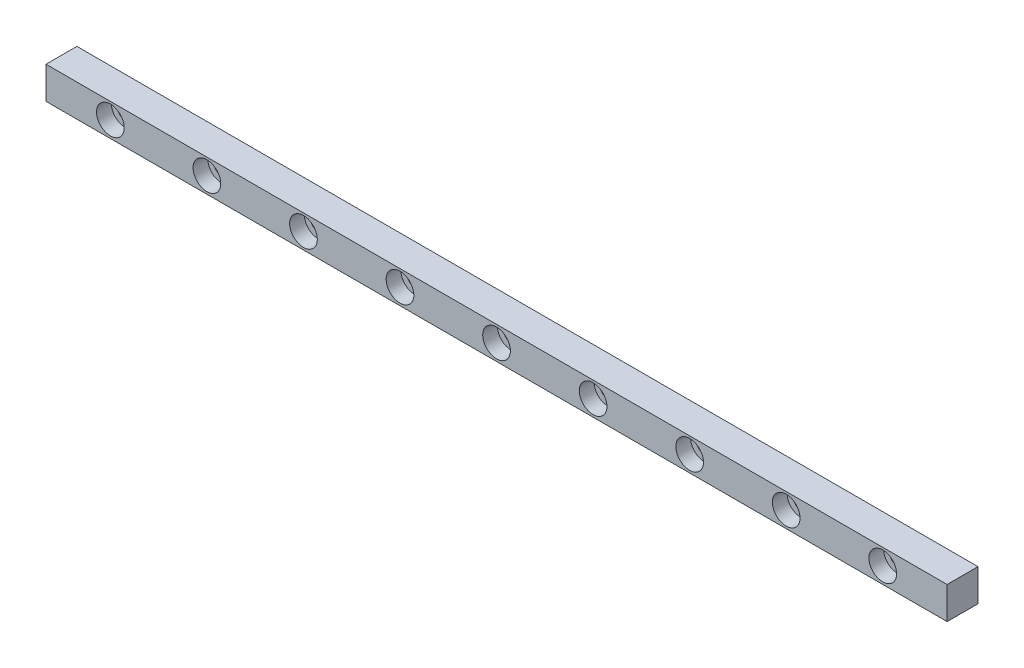
ISO-10303-21;
HEADER;
FILE_DESCRIPTION(('STEP AP214'),'2;1');
FILE_NAME('part.step','',(''),(''),'','','');
FILE_SCHEMA(('AUTOMOTIVE_DESIGN { 1 0 10303 214 1 1 1 1 }'));
ENDSEC;
DATA;
#1=APPLICATION_CONTEXT('core data for automotive mechanical design processes');
#2=APPLICATION_PROTOCOL_DEFINITION('international standard','automotive_design',2000,#1);
#3=PRODUCT_CONTEXT('',#1,'mechanical');
#4=PRODUCT('Part','Part','',(#3));
#5=PRODUCT_RELATED_PRODUCT_CATEGORY('part','',(#4));
#6=PRODUCT_DEFINITION_FORMATION('','',#4);
#7=PRODUCT_DEFINITION_CONTEXT('part definition',#1,'design');
#8=PRODUCT_DEFINITION('design','',#6,#7);
#9=PRODUCT_DEFINITION_SHAPE('','',#8);
#10=(LENGTH_UNIT() NAMED_UNIT(*) SI_UNIT(.MILLI.,.METRE.));
#11=(NAMED_UNIT(*) PLANE_ANGLE_UNIT() SI_UNIT($,.RADIAN.));
#12=(NAMED_UNIT(*) SI_UNIT($,.STERADIAN.) SOLID_ANGLE_UNIT());
#13=UNCERTAINTY_MEASURE_WITH_UNIT(LENGTH_MEASURE(1.E-05),#10,'distance_accuracy_value','');
#14=(GEOMETRIC_REPRESENTATION_CONTEXT(3) GLOBAL_UNCERTAINTY_ASSIGNED_CONTEXT((#13)) GLOBAL_UNIT_ASSIGNED_CONTEXT((#10,
#11,#12)) REPRESENTATION_CONTEXT('',''));
#15=CARTESIAN_POINT('',(0.,0.,0.));
#16=DIRECTION('',(0.,0.,1.));
#17=DIRECTION('',(1.,0.,0.));
#18=AXIS2_PLACEMENT_3D('',#15,#16,#17);
#19=CARTESIAN_POINT('',(-70.,-2.50000000000001,4.8));
#20=DIRECTION('',(1.,0.,0.));
#21=DIRECTION('',(0.,0.,-1.));
#22=AXIS2_PLACEMENT_3D('',#19,#20,#21);
#23=PLANE('',#22);
#24=DIRECTION('',(0.,-1.,0.));
#25=VECTOR('',#24,1.);
#26=CARTESIAN_POINT('',(-70.,-2.50000000000001,0.));
#27=LINE('',#26,#25);
#28=CARTESIAN_POINT('',(-70.,2.49999999999999,0.));
#29=VERTEX_POINT('',#28);
#30=CARTESIAN_POINT('',(-70.,-2.50000000000001,0.));
#31=VERTEX_POINT('',#30);
#32=EDGE_CURVE('E110',#29,#31,#27,.T.);
#33=ORIENTED_EDGE('',*,*,#32,.T.);
#34=DIRECTION('',(0.,0.,-1.));
#35=VECTOR('',#34,1.);
#36=CARTESIAN_POINT('',(-70.,-2.50000000000001,4.8));
#37=LINE('',#36,#35);
#38=CARTESIAN_POINT('',(-70.,-2.50000000000001,4.8));
#39=VERTEX_POINT('',#38);
#40=EDGE_CURVE('E11',#39,#31,#37,.T.);
#41=ORIENTED_EDGE('',*,*,#40,.F.);
#42=DIRECTION('',(0.,-1.,0.));
#43=VECTOR('',#42,1.);
#44=CARTESIAN_POINT('',(-70.,-2.50000000000001,4.8));
#45=LINE('',#44,#43);
#46=CARTESIAN_POINT('',(-70.,2.49999999999999,4.8));
#47=VERTEX_POINT('',#46);
#48=EDGE_CURVE('E93',#47,#39,#45,.T.);
#49=ORIENTED_EDGE('',*,*,#48,.F.);
#50=DIRECTION('',(0.,0.,-1.));
#51=VECTOR('',#50,1.);
#52=CARTESIAN_POINT('',(-70.,2.49999999999999,4.8));
#53=LINE('',#52,#51);
#54=EDGE_CURVE('E106',#47,#29,#53,.T.);
#55=ORIENTED_EDGE('',*,*,#54,.T.);
#56=EDGE_LOOP('',(#33,#41,#49,#55));
#57=FACE_BOUND('',#56,.T.);
#58=ADVANCED_FACE('F39',(#57),#23,.F.);
#59=CARTESIAN_POINT('',(70.,-2.49999999999999,4.8));
#60=DIRECTION('',(0.,1.,0.));
#61=DIRECTION('',(-1.,0.,0.));
#62=AXIS2_PLACEMENT_3D('',#59,#60,#61);
#63=PLANE('',#62);
#64=DIRECTION('',(1.,0.,0.));
#65=VECTOR('',#64,1.);
#66=CARTESIAN_POINT('',(70.,-2.49999999999999,0.));
#67=LINE('',#66,#65);
#68=CARTESIAN_POINT('',(70.,-2.49999999999999,0.));
#69=VERTEX_POINT('',#68);
#70=EDGE_CURVE('E98',#31,#69,#67,.T.);
#71=ORIENTED_EDGE('',*,*,#70,.T.);
#72=DIRECTION('',(0.,0.,-1.));
#73=VECTOR('',#72,1.);
#74=CARTESIAN_POINT('',(70.,-2.49999999999999,4.8));
#75=LINE('',#74,#73);
#76=CARTESIAN_POINT('',(70.,-2.49999999999999,4.8));
#77=VERTEX_POINT('',#76);
#78=EDGE_CURVE('E49',#77,#69,#75,.T.);
#79=ORIENTED_EDGE('',*,*,#78,.F.);
#80=DIRECTION('',(1.,0.,0.));
#81=VECTOR('',#80,1.);
#82=CARTESIAN_POINT('',(70.,-2.49999999999999,4.8));
#83=LINE('',#82,#81);
#84=EDGE_CURVE('E88',#39,#77,#83,.T.);
#85=ORIENTED_EDGE('',*,*,#84,.F.);
#86=ORIENTED_EDGE('',*,*,#40,.T.);
#87=EDGE_LOOP('',(#71,#79,#85,#86));
#88=FACE_BOUND('',#87,.T.);
#89=ADVANCED_FACE('F97',(#88),#63,.F.);
#90=CARTESIAN_POINT('',(70.,-2.49999999999999,4.8));
#91=DIRECTION('',(-1.,0.,0.));
#92=DIRECTION('',(0.,0.,1.));
#93=AXIS2_PLACEMENT_3D('',#90,#91,#92);
#94=PLANE('',#93);
#95=DIRECTION('',(0.,1.,0.));
#96=VECTOR('',#95,1.);
#97=CARTESIAN_POINT('',(70.,-2.49999999999999,0.));
#98=LINE('',#97,#96);
#99=CARTESIAN_POINT('',(70.,2.50000000000001,0.));
#100=VERTEX_POINT('',#99);
#101=EDGE_CURVE('E75',#69,#100,#98,.T.);
#102=ORIENTED_EDGE('',*,*,#101,.T.);
#103=DIRECTION('',(0.,0.,-1.));
#104=VECTOR('',#103,1.);
#105=CARTESIAN_POINT('',(70.,2.50000000000001,4.8));
#106=LINE('',#105,#104);
#107=CARTESIAN_POINT('',(70.,2.50000000000001,4.8));
#108=VERTEX_POINT('',#107);
#109=EDGE_CURVE('E100',#108,#100,#106,.T.);
#110=ORIENTED_EDGE('',*,*,#109,.F.);
#111=DIRECTION('',(0.,1.,0.));
#112=VECTOR('',#111,1.);
#113=CARTESIAN_POINT('',(70.,-2.49999999999999,4.8));
#114=LINE('',#113,#112);
#115=EDGE_CURVE('E91',#77,#108,#114,.T.);
#116=ORIENTED_EDGE('',*,*,#115,.F.);
#117=ORIENTED_EDGE('',*,*,#78,.T.);
#118=EDGE_LOOP('',(#102,#110,#116,#117));
#119=FACE_BOUND('',#118,.T.);
#120=ADVANCED_FACE('F102',(#119),#94,.F.);
#121=CARTESIAN_POINT('',(70.,2.50000000000001,4.8));
#122=DIRECTION('',(0.,-1.,0.));
#123=DIRECTION('',(1.,0.,0.));
#124=AXIS2_PLACEMENT_3D('',#121,#122,#123);
#125=PLANE('',#124);
#126=DIRECTION('',(-1.,0.,0.));
#127=VECTOR('',#126,1.);
#128=CARTESIAN_POINT('',(70.,2.50000000000001,0.));
#129=LINE('',#128,#127);
#130=EDGE_CURVE('E81',#100,#29,#129,.T.);
#131=ORIENTED_EDGE('',*,*,#130,.T.);
#132=ORIENTED_EDGE('',*,*,#54,.F.);
#133=DIRECTION('',(-1.,0.,0.));
#134=VECTOR('',#133,1.);
#135=CARTESIAN_POINT('',(70.,2.50000000000001,4.8));
#136=LINE('',#135,#134);
#137=EDGE_CURVE('E58',#108,#47,#136,.T.);
#138=ORIENTED_EDGE('',*,*,#137,.F.);
#139=ORIENTED_EDGE('',*,*,#109,.T.);
#140=EDGE_LOOP('',(#131,#132,#138,#139));
#141=FACE_BOUND('',#140,.T.);
#142=ADVANCED_FACE('F273',(#141),#125,.F.);
#143=CARTESIAN_POINT('',(0.,0.,4.8));
#144=DIRECTION('',(0.,0.,1.));
#145=DIRECTION('',(1.,0.,0.));
#146=AXIS2_PLACEMENT_3D('',#143,#144,#145);
#147=PLANE('',#146);
#148=CARTESIAN_POINT('',(-60.,0.,4.8));
#149=DIRECTION('',(0.,0.,1.));
#150=DIRECTION('',(1.,0.,0.));
#151=AXIS2_PLACEMENT_3D('',#148,#149,#150);
#152=CIRCLE('',#151,2.15);
#153=CARTESIAN_POINT('',(-57.85,0.,4.8));
#154=VERTEX_POINT('',#153);
#155=EDGE_CURVE('E579',#154,#154,#152,.T.);
#156=ORIENTED_EDGE('',*,*,#155,.F.);
#157=EDGE_LOOP('',(#156));
#158=FACE_BOUND('',#157,.T.);
#159=CARTESIAN_POINT('',(-45.,0.,4.8));
#160=DIRECTION('',(0.,0.,1.));
#161=DIRECTION('',(1.,0.,0.));
#162=AXIS2_PLACEMENT_3D('',#159,#160,#161);
#163=CIRCLE('',#162,2.15);
#164=CARTESIAN_POINT('',(-42.85,0.,4.8));
#165=VERTEX_POINT('',#164);
#166=EDGE_CURVE('E183',#165,#165,#163,.T.);
#167=ORIENTED_EDGE('',*,*,#166,.F.);
#168=EDGE_LOOP('',(#167));
#169=FACE_BOUND('',#168,.T.);
#170=CARTESIAN_POINT('',(-30.,0.,4.8));
#171=DIRECTION('',(0.,0.,1.));
#172=DIRECTION('',(1.,0.,0.));
#173=AXIS2_PLACEMENT_3D('',#170,#171,#172);
#174=CIRCLE('',#173,2.15);
#175=CARTESIAN_POINT('',(-27.85,0.,4.8));
#176=VERTEX_POINT('',#175);
#177=EDGE_CURVE('E167',#176,#176,#174,.T.);
#178=ORIENTED_EDGE('',*,*,#177,.F.);
#179=EDGE_LOOP('',(#178));
#180=FACE_BOUND('',#179,.T.);
#181=CARTESIAN_POINT('',(-15.,0.,4.8));
#182=DIRECTION('',(0.,0.,1.));
#183=DIRECTION('',(1.,0.,0.));
#184=AXIS2_PLACEMENT_3D('',#181,#182,#183);
#185=CIRCLE('',#184,2.15);
#186=CARTESIAN_POINT('',(-12.85,0.,4.8));
#187=VERTEX_POINT('',#186);
#188=EDGE_CURVE('E162',#187,#187,#185,.T.);
#189=ORIENTED_EDGE('',*,*,#188,.F.);
#190=EDGE_LOOP('',(#189));
#191=FACE_BOUND('',#190,.T.);
#192=CARTESIAN_POINT('',(0.,0.,4.8));
#193=DIRECTION('',(0.,0.,1.));
#194=DIRECTION('',(1.,0.,0.));
#195=AXIS2_PLACEMENT_3D('',#192,#193,#194);
#196=CIRCLE('',#195,2.15);
#197=CARTESIAN_POINT('',(2.15000000000001,0.,4.8));
#198=VERTEX_POINT('',#197);
#199=EDGE_CURVE('E157',#198,#198,#196,.T.);
#200=ORIENTED_EDGE('',*,*,#199,.F.);
#201=EDGE_LOOP('',(#200));
#202=FACE_BOUND('',#201,.T.);
#203=CARTESIAN_POINT('',(15.,0.,4.8));
#204=DIRECTION('',(0.,0.,1.));
#205=DIRECTION('',(1.,0.,0.));
#206=AXIS2_PLACEMENT_3D('',#203,#204,#205);
#207=CIRCLE('',#206,2.15);
#208=CARTESIAN_POINT('',(17.15,0.,4.8));
#209=VERTEX_POINT('',#208);
#210=EDGE_CURVE('E151',#209,#209,#207,.T.);
#211=ORIENTED_EDGE('',*,*,#210,.F.);
#212=EDGE_LOOP('',(#211));
#213=FACE_BOUND('',#212,.T.);
#214=CARTESIAN_POINT('',(30.,0.,4.8));
#215=DIRECTION('',(0.,0.,1.));
#216=DIRECTION('',(1.,0.,0.));
#217=AXIS2_PLACEMENT_3D('',#214,#215,#216);
#218=CIRCLE('',#217,2.15);
#219=CARTESIAN_POINT('',(32.15,0.,4.8));
#220=VERTEX_POINT('',#219);
#221=EDGE_CURVE('E145',#220,#220,#218,.T.);
#222=ORIENTED_EDGE('',*,*,#221,.F.);
#223=EDGE_LOOP('',(#222));
#224=FACE_BOUND('',#223,.T.);
#225=CARTESIAN_POINT('',(45.,0.,4.8));
#226=DIRECTION('',(0.,0.,1.));
#227=DIRECTION('',(1.,0.,0.));
#228=AXIS2_PLACEMENT_3D('',#225,#226,#227);
#229=CIRCLE('',#228,2.15);
#230=CARTESIAN_POINT('',(47.15,0.,4.8));
#231=VERTEX_POINT('',#230);
#232=EDGE_CURVE('E139',#231,#231,#229,.T.);
#233=ORIENTED_EDGE('',*,*,#232,.F.);
#234=EDGE_LOOP('',(#233));
#235=FACE_BOUND('',#234,.T.);
#236=CARTESIAN_POINT('',(60.,0.,4.8));
#237=DIRECTION('',(0.,0.,1.));
#238=DIRECTION('',(1.,0.,0.));
#239=AXIS2_PLACEMENT_3D('',#236,#237,#238);
#240=CIRCLE('',#239,2.15);
#241=CARTESIAN_POINT('',(62.15,0.,4.8));
#242=VERTEX_POINT('',#241);
#243=EDGE_CURVE('E133',#242,#242,#240,.T.);
#244=ORIENTED_EDGE('',*,*,#243,.F.);
#245=EDGE_LOOP('',(#244));
#246=FACE_BOUND('',#245,.T.);
#247=ORIENTED_EDGE('',*,*,#48,.T.);
#248=ORIENTED_EDGE('',*,*,#84,.T.);
#249=ORIENTED_EDGE('',*,*,#115,.T.);
#250=ORIENTED_EDGE('',*,*,#137,.T.);
#251=EDGE_LOOP('',(#247,#248,#249,#250));
#252=FACE_BOUND('',#251,.T.);
#253=ADVANCED_FACE('F89',(#158,#169,#180,#191,#202,#213,#224,#235,#246,#252),#147,.T.);
#254=CARTESIAN_POINT('',(0.,0.,0.));
#255=DIRECTION('',(0.,0.,1.));
#256=DIRECTION('',(1.,0.,0.));
#257=AXIS2_PLACEMENT_3D('',#254,#255,#256);
#258=PLANE('',#257);
#259=CARTESIAN_POINT('',(-60.,0.,0.));
#260=DIRECTION('',(0.,0.,1.));
#261=DIRECTION('',(1.,0.,0.));
#262=AXIS2_PLACEMENT_3D('',#259,#260,#261);
#263=CIRCLE('',#262,1.2);
#264=CARTESIAN_POINT('',(-58.8,0.,0.));
#265=VERTEX_POINT('',#264);
#266=EDGE_CURVE('E42',#265,#265,#263,.T.);
#267=ORIENTED_EDGE('',*,*,#266,.T.);
#268=EDGE_LOOP('',(#267));
#269=FACE_BOUND('',#268,.T.);
#270=CARTESIAN_POINT('',(-45.,0.,0.));
#271=DIRECTION('',(0.,0.,1.));
#272=DIRECTION('',(1.,0.,0.));
#273=AXIS2_PLACEMENT_3D('',#270,#271,#272);
#274=CIRCLE('',#273,1.2);
#275=CARTESIAN_POINT('',(-43.8,0.,0.));
#276=VERTEX_POINT('',#275);
#277=EDGE_CURVE('E164',#276,#276,#274,.T.);
#278=ORIENTED_EDGE('',*,*,#277,.T.);
#279=EDGE_LOOP('',(#278));
#280=FACE_BOUND('',#279,.T.);
#281=CARTESIAN_POINT('',(-30.,0.,0.));
#282=DIRECTION('',(0.,0.,1.));
#283=DIRECTION('',(1.,0.,0.));
#284=AXIS2_PLACEMENT_3D('',#281,#282,#283);
#285=CIRCLE('',#284,1.2);
#286=CARTESIAN_POINT('',(-28.8,0.,0.));
#287=VERTEX_POINT('',#286);
#288=EDGE_CURVE('E159',#287,#287,#285,.T.);
#289=ORIENTED_EDGE('',*,*,#288,.T.);
#290=EDGE_LOOP('',(#289));
#291=FACE_BOUND('',#290,.T.);
#292=CARTESIAN_POINT('',(-15.,0.,0.));
#293=DIRECTION('',(0.,0.,1.));
#294=DIRECTION('',(1.,0.,0.));
#295=AXIS2_PLACEMENT_3D('',#292,#293,#294);
#296=CIRCLE('',#295,1.2);
#297=CARTESIAN_POINT('',(-13.8,0.,0.));
#298=VERTEX_POINT('',#297);
#299=EDGE_CURVE('E153',#298,#298,#296,.T.);
#300=ORIENTED_EDGE('',*,*,#299,.T.);
#301=EDGE_LOOP('',(#300));
#302=FACE_BOUND('',#301,.T.);
#303=CARTESIAN_POINT('',(0.,0.,0.));
#304=DIRECTION('',(0.,0.,1.));
#305=DIRECTION('',(1.,0.,0.));
#306=AXIS2_PLACEMENT_3D('',#303,#304,#305);
#307=CIRCLE('',#306,1.2);
#308=CARTESIAN_POINT('',(1.20000000000001,0.,0.));
#309=VERTEX_POINT('',#308);
#310=EDGE_CURVE('E147',#309,#309,#307,.T.);
#311=ORIENTED_EDGE('',*,*,#310,.T.);
#312=EDGE_LOOP('',(#311));
#313=FACE_BOUND('',#312,.T.);
#314=CARTESIAN_POINT('',(15.,0.,0.));
#315=DIRECTION('',(0.,0.,1.));
#316=DIRECTION('',(1.,0.,0.));
#317=AXIS2_PLACEMENT_3D('',#314,#315,#316);
#318=CIRCLE('',#317,1.2);
#319=CARTESIAN_POINT('',(16.2,0.,0.));
#320=VERTEX_POINT('',#319);
#321=EDGE_CURVE('E141',#320,#320,#318,.T.);
#322=ORIENTED_EDGE('',*,*,#321,.T.);
#323=EDGE_LOOP('',(#322));
#324=FACE_BOUND('',#323,.T.);
#325=CARTESIAN_POINT('',(30.,0.,0.));
#326=DIRECTION('',(0.,0.,1.));
#327=DIRECTION('',(1.,0.,0.));
#328=AXIS2_PLACEMENT_3D('',#325,#326,#327);
#329=CIRCLE('',#328,1.2);
#330=CARTESIAN_POINT('',(31.2,0.,0.));
#331=VERTEX_POINT('',#330);
#332=EDGE_CURVE('E135',#331,#331,#329,.T.);
#333=ORIENTED_EDGE('',*,*,#332,.T.);
#334=EDGE_LOOP('',(#333));
#335=FACE_BOUND('',#334,.T.);
#336=CARTESIAN_POINT('',(45.,0.,0.));
#337=DIRECTION('',(0.,0.,1.));
#338=DIRECTION('',(1.,0.,0.));
#339=AXIS2_PLACEMENT_3D('',#336,#337,#338);
#340=CIRCLE('',#339,1.2);
#341=CARTESIAN_POINT('',(46.2,0.,0.));
#342=VERTEX_POINT('',#341);
#343=EDGE_CURVE('E129',#342,#342,#340,.T.);
#344=ORIENTED_EDGE('',*,*,#343,.T.);
#345=EDGE_LOOP('',(#344));
#346=FACE_BOUND('',#345,.T.);
#347=CARTESIAN_POINT('',(60.,0.,0.));
#348=DIRECTION('',(0.,0.,1.));
#349=DIRECTION('',(1.,0.,0.));
#350=AXIS2_PLACEMENT_3D('',#347,#348,#349);
#351=CIRCLE('',#350,1.2);
#352=CARTESIAN_POINT('',(61.2,0.,0.));
#353=VERTEX_POINT('',#352);
#354=EDGE_CURVE('E114',#353,#353,#351,.T.);
#355=ORIENTED_EDGE('',*,*,#354,.T.);
#356=EDGE_LOOP('',(#355));
#357=FACE_BOUND('',#356,.T.);
#358=ORIENTED_EDGE('',*,*,#32,.F.);
#359=ORIENTED_EDGE('',*,*,#130,.F.);
#360=ORIENTED_EDGE('',*,*,#101,.F.);
#361=ORIENTED_EDGE('',*,*,#70,.F.);
#362=EDGE_LOOP('',(#358,#359,#360,#361));
#363=FACE_BOUND('',#362,.T.);
#364=ADVANCED_FACE('F272',(#269,#280,#291,#302,#313,#324,#335,#346,#357,#363),#258,.F.);
#365=CARTESIAN_POINT('',(60.,0.,4.8));
#366=DIRECTION('',(0.,0.,1.));
#367=DIRECTION('',(1.,0.,0.));
#368=AXIS2_PLACEMENT_3D('',#365,#366,#367);
#369=CYLINDRICAL_SURFACE('',#368,1.2);
#370=CARTESIAN_POINT('',(60.,0.,2.5));
#371=DIRECTION('',(0.,0.,1.));
#372=DIRECTION('',(1.,0.,0.));
#373=AXIS2_PLACEMENT_3D('',#370,#371,#372);
#374=CIRCLE('',#373,1.2);
#375=CARTESIAN_POINT('',(61.2,0.,2.5));
#376=VERTEX_POINT('',#375);
#377=EDGE_CURVE('E128',#376,#376,#374,.T.);
#378=ORIENTED_EDGE('',*,*,#377,.T.);
#379=EDGE_LOOP('',(#378));
#380=FACE_BOUND('',#379,.T.);
#381=ORIENTED_EDGE('',*,*,#354,.F.);
#382=EDGE_LOOP('',(#381));
#383=FACE_BOUND('',#382,.T.);
#384=ADVANCED_FACE('F255',(#380,#383),#369,.F.);
#385=CARTESIAN_POINT('',(61.2,0.,2.5));
#386=DIRECTION('',(0.,0.,-1.));
#387=DIRECTION('',(-1.,0.,0.));
#388=AXIS2_PLACEMENT_3D('',#385,#386,#387);
#389=PLANE('',#388);
#390=ORIENTED_EDGE('',*,*,#377,.F.);
#391=EDGE_LOOP('',(#390));
#392=FACE_BOUND('',#391,.T.);
#393=CARTESIAN_POINT('',(60.,0.,2.5));
#394=DIRECTION('',(0.,0.,1.));
#395=DIRECTION('',(1.,0.,0.));
#396=AXIS2_PLACEMENT_3D('',#393,#394,#395);
#397=CIRCLE('',#396,2.15);
#398=CARTESIAN_POINT('',(62.15,0.,2.5));
#399=VERTEX_POINT('',#398);
#400=EDGE_CURVE('E246',#399,#399,#397,.T.);
#401=ORIENTED_EDGE('',*,*,#400,.T.);
#402=EDGE_LOOP('',(#401));
#403=FACE_BOUND('',#402,.T.);
#404=ADVANCED_FACE('F258',(#392,#403),#389,.F.);
#405=CARTESIAN_POINT('',(60.,0.,4.8));
#406=DIRECTION('',(0.,0.,1.));
#407=DIRECTION('',(1.,0.,0.));
#408=AXIS2_PLACEMENT_3D('',#405,#406,#407);
#409=CYLINDRICAL_SURFACE('',#408,2.15);
#410=ORIENTED_EDGE('',*,*,#400,.F.);
#411=EDGE_LOOP('',(#410));
#412=FACE_BOUND('',#411,.T.);
#413=ORIENTED_EDGE('',*,*,#243,.T.);
#414=EDGE_LOOP('',(#413));
#415=FACE_BOUND('',#414,.T.);
#416=ADVANCED_FACE('F261',(#412,#415),#409,.F.);
#417=CARTESIAN_POINT('',(45.,0.,4.8));
#418=DIRECTION('',(0.,0.,1.));
#419=DIRECTION('',(1.,0.,0.));
#420=AXIS2_PLACEMENT_3D('',#417,#418,#419);
#421=CYLINDRICAL_SURFACE('',#420,1.2);
#422=CARTESIAN_POINT('',(45.,0.,2.5));
#423=DIRECTION('',(0.,0.,1.));
#424=DIRECTION('',(1.,0.,0.));
#425=AXIS2_PLACEMENT_3D('',#422,#423,#424);
#426=CIRCLE('',#425,1.2);
#427=CARTESIAN_POINT('',(46.2,0.,2.5));
#428=VERTEX_POINT('',#427);
#429=EDGE_CURVE('E134',#428,#428,#426,.T.);
#430=ORIENTED_EDGE('',*,*,#429,.T.);
#431=EDGE_LOOP('',(#430));
#432=FACE_BOUND('',#431,.T.);
#433=ORIENTED_EDGE('',*,*,#343,.F.);
#434=EDGE_LOOP('',(#433));
#435=FACE_BOUND('',#434,.T.);
#436=ADVANCED_FACE('F267',(#432,#435),#421,.F.);
#437=CARTESIAN_POINT('',(46.2,0.,2.5));
#438=DIRECTION('',(0.,0.,-1.));
#439=DIRECTION('',(-1.,0.,0.));
#440=AXIS2_PLACEMENT_3D('',#437,#438,#439);
#441=PLANE('',#440);
#442=ORIENTED_EDGE('',*,*,#429,.F.);
#443=EDGE_LOOP('',(#442));
#444=FACE_BOUND('',#443,.T.);
#445=CARTESIAN_POINT('',(45.,0.,2.5));
#446=DIRECTION('',(0.,0.,1.));
#447=DIRECTION('',(1.,0.,0.));
#448=AXIS2_PLACEMENT_3D('',#445,#446,#447);
#449=CIRCLE('',#448,2.15);
#450=CARTESIAN_POINT('',(47.15,0.,2.5));
#451=VERTEX_POINT('',#450);
#452=EDGE_CURVE('E236',#451,#451,#449,.T.);
#453=ORIENTED_EDGE('',*,*,#452,.T.);
#454=EDGE_LOOP('',(#453));
#455=FACE_BOUND('',#454,.T.);
#456=ADVANCED_FACE('F341',(#444,#455),#441,.F.);
#457=CARTESIAN_POINT('',(45.,0.,4.8));
#458=DIRECTION('',(0.,0.,1.));
#459=DIRECTION('',(1.,0.,0.));
#460=AXIS2_PLACEMENT_3D('',#457,#458,#459);
#461=CYLINDRICAL_SURFACE('',#460,2.15);
#462=ORIENTED_EDGE('',*,*,#452,.F.);
#463=EDGE_LOOP('',(#462));
#464=FACE_BOUND('',#463,.T.);
#465=ORIENTED_EDGE('',*,*,#232,.T.);
#466=EDGE_LOOP('',(#465));
#467=FACE_BOUND('',#466,.T.);
#468=ADVANCED_FACE('F351',(#464,#467),#461,.F.);
#469=CARTESIAN_POINT('',(30.,0.,4.8));
#470=DIRECTION('',(0.,0.,1.));
#471=DIRECTION('',(1.,0.,0.));
#472=AXIS2_PLACEMENT_3D('',#469,#470,#471);
#473=CYLINDRICAL_SURFACE('',#472,1.2);
#474=CARTESIAN_POINT('',(30.,0.,2.5));
#475=DIRECTION('',(0.,0.,1.));
#476=DIRECTION('',(1.,0.,0.));
#477=AXIS2_PLACEMENT_3D('',#474,#475,#476);
#478=CIRCLE('',#477,1.2);
#479=CARTESIAN_POINT('',(31.2,0.,2.5));
#480=VERTEX_POINT('',#479);
#481=EDGE_CURVE('E140',#480,#480,#478,.T.);
#482=ORIENTED_EDGE('',*,*,#481,.T.);
#483=EDGE_LOOP('',(#482));
#484=FACE_BOUND('',#483,.T.);
#485=ORIENTED_EDGE('',*,*,#332,.F.);
#486=EDGE_LOOP('',(#485));
#487=FACE_BOUND('',#486,.T.);
#488=ADVANCED_FACE('F361',(#484,#487),#473,.F.);
#489=CARTESIAN_POINT('',(31.2,0.,2.5));
#490=DIRECTION('',(0.,0.,-1.));
#491=DIRECTION('',(-1.,0.,0.));
#492=AXIS2_PLACEMENT_3D('',#489,#490,#491);
#493=PLANE('',#492);
#494=ORIENTED_EDGE('',*,*,#481,.F.);
#495=EDGE_LOOP('',(#494));
#496=FACE_BOUND('',#495,.T.);
#497=CARTESIAN_POINT('',(30.,0.,2.5));
#498=DIRECTION('',(0.,0.,1.));
#499=DIRECTION('',(1.,0.,0.));
#500=AXIS2_PLACEMENT_3D('',#497,#498,#499);
#501=CIRCLE('',#500,2.15);
#502=CARTESIAN_POINT('',(32.15,0.,2.5));
#503=VERTEX_POINT('',#502);
#504=EDGE_CURVE('E226',#503,#503,#501,.T.);
#505=ORIENTED_EDGE('',*,*,#504,.T.);
#506=EDGE_LOOP('',(#505));
#507=FACE_BOUND('',#506,.T.);
#508=ADVANCED_FACE('F371',(#496,#507),#493,.F.);
#509=CARTESIAN_POINT('',(30.,0.,4.8));
#510=DIRECTION('',(0.,0.,1.));
#511=DIRECTION('',(1.,0.,0.));
#512=AXIS2_PLACEMENT_3D('',#509,#510,#511);
#513=CYLINDRICAL_SURFACE('',#512,2.15);
#514=ORIENTED_EDGE('',*,*,#504,.F.);
#515=EDGE_LOOP('',(#514));
#516=FACE_BOUND('',#515,.T.);
#517=ORIENTED_EDGE('',*,*,#221,.T.);
#518=EDGE_LOOP('',(#517));
#519=FACE_BOUND('',#518,.T.);
#520=ADVANCED_FACE('F381',(#516,#519),#513,.F.);
#521=CARTESIAN_POINT('',(15.,0.,4.8));
#522=DIRECTION('',(0.,0.,1.));
#523=DIRECTION('',(1.,0.,0.));
#524=AXIS2_PLACEMENT_3D('',#521,#522,#523);
#525=CYLINDRICAL_SURFACE('',#524,1.2);
#526=CARTESIAN_POINT('',(15.,0.,2.5));
#527=DIRECTION('',(0.,0.,1.));
#528=DIRECTION('',(1.,0.,0.));
#529=AXIS2_PLACEMENT_3D('',#526,#527,#528);
#530=CIRCLE('',#529,1.2);
#531=CARTESIAN_POINT('',(16.2,0.,2.5));
#532=VERTEX_POINT('',#531);
#533=EDGE_CURVE('E146',#532,#532,#530,.T.);
#534=ORIENTED_EDGE('',*,*,#533,.T.);
#535=EDGE_LOOP('',(#534));
#536=FACE_BOUND('',#535,.T.);
#537=ORIENTED_EDGE('',*,*,#321,.F.);
#538=EDGE_LOOP('',(#537));
#539=FACE_BOUND('',#538,.T.);
#540=ADVANCED_FACE('F391',(#536,#539),#525,.F.);
#541=CARTESIAN_POINT('',(16.2,0.,2.5));
#542=DIRECTION('',(0.,0.,-1.));
#543=DIRECTION('',(-1.,0.,0.));
#544=AXIS2_PLACEMENT_3D('',#541,#542,#543);
#545=PLANE('',#544);
#546=ORIENTED_EDGE('',*,*,#533,.F.);
#547=EDGE_LOOP('',(#546));
#548=FACE_BOUND('',#547,.T.);
#549=CARTESIAN_POINT('',(15.,0.,2.5));
#550=DIRECTION('',(0.,0.,1.));
#551=DIRECTION('',(1.,0.,0.));
#552=AXIS2_PLACEMENT_3D('',#549,#550,#551);
#553=CIRCLE('',#552,2.15);
#554=CARTESIAN_POINT('',(17.15,0.,2.5));
#555=VERTEX_POINT('',#554);
#556=EDGE_CURVE('E216',#555,#555,#553,.T.);
#557=ORIENTED_EDGE('',*,*,#556,.T.);
#558=EDGE_LOOP('',(#557));
#559=FACE_BOUND('',#558,.T.);
#560=ADVANCED_FACE('F401',(#548,#559),#545,.F.);
#561=CARTESIAN_POINT('',(15.,0.,4.8));
#562=DIRECTION('',(0.,0.,1.));
#563=DIRECTION('',(1.,0.,0.));
#564=AXIS2_PLACEMENT_3D('',#561,#562,#563);
#565=CYLINDRICAL_SURFACE('',#564,2.15);
#566=ORIENTED_EDGE('',*,*,#556,.F.);
#567=EDGE_LOOP('',(#566));
#568=FACE_BOUND('',#567,.T.);
#569=ORIENTED_EDGE('',*,*,#210,.T.);
#570=EDGE_LOOP('',(#569));
#571=FACE_BOUND('',#570,.T.);
#572=ADVANCED_FACE('F411',(#568,#571),#565,.F.);
#573=CARTESIAN_POINT('',(0.,0.,4.8));
#574=DIRECTION('',(0.,0.,1.));
#575=DIRECTION('',(1.,0.,0.));
#576=AXIS2_PLACEMENT_3D('',#573,#574,#575);
#577=CYLINDRICAL_SURFACE('',#576,1.2);
#578=CARTESIAN_POINT('',(0.,0.,2.5));
#579=DIRECTION('',(0.,0.,1.));
#580=DIRECTION('',(1.,0.,0.));
#581=AXIS2_PLACEMENT_3D('',#578,#579,#580);
#582=CIRCLE('',#581,1.2);
#583=CARTESIAN_POINT('',(1.20000000000001,0.,2.5));
#584=VERTEX_POINT('',#583);
#585=EDGE_CURVE('E152',#584,#584,#582,.T.);
#586=ORIENTED_EDGE('',*,*,#585,.T.);
#587=EDGE_LOOP('',(#586));
#588=FACE_BOUND('',#587,.T.);
#589=ORIENTED_EDGE('',*,*,#310,.F.);
#590=EDGE_LOOP('',(#589));
#591=FACE_BOUND('',#590,.T.);
#592=ADVANCED_FACE('F421',(#588,#591),#577,.F.);
#593=CARTESIAN_POINT('',(1.20000000000001,0.,2.5));
#594=DIRECTION('',(0.,0.,-1.));
#595=DIRECTION('',(-1.,0.,0.));
#596=AXIS2_PLACEMENT_3D('',#593,#594,#595);
#597=PLANE('',#596);
#598=ORIENTED_EDGE('',*,*,#585,.F.);
#599=EDGE_LOOP('',(#598));
#600=FACE_BOUND('',#599,.T.);
#601=CARTESIAN_POINT('',(0.,0.,2.5));
#602=DIRECTION('',(0.,0.,1.));
#603=DIRECTION('',(1.,0.,0.));
#604=AXIS2_PLACEMENT_3D('',#601,#602,#603);
#605=CIRCLE('',#604,2.15);
#606=CARTESIAN_POINT('',(2.15000000000001,0.,2.5));
#607=VERTEX_POINT('',#606);
#608=EDGE_CURVE('E206',#607,#607,#605,.T.);
#609=ORIENTED_EDGE('',*,*,#608,.T.);
#610=EDGE_LOOP('',(#609));
#611=FACE_BOUND('',#610,.T.);
#612=ADVANCED_FACE('F431',(#600,#611),#597,.F.);
#613=CARTESIAN_POINT('',(0.,0.,4.8));
#614=DIRECTION('',(0.,0.,1.));
#615=DIRECTION('',(1.,0.,0.));
#616=AXIS2_PLACEMENT_3D('',#613,#614,#615);
#617=CYLINDRICAL_SURFACE('',#616,2.15);
#618=ORIENTED_EDGE('',*,*,#608,.F.);
#619=EDGE_LOOP('',(#618));
#620=FACE_BOUND('',#619,.T.);
#621=ORIENTED_EDGE('',*,*,#199,.T.);
#622=EDGE_LOOP('',(#621));
#623=FACE_BOUND('',#622,.T.);
#624=ADVANCED_FACE('F441',(#620,#623),#617,.F.);
#625=CARTESIAN_POINT('',(-15.,0.,4.8));
#626=DIRECTION('',(0.,0.,1.));
#627=DIRECTION('',(1.,0.,0.));
#628=AXIS2_PLACEMENT_3D('',#625,#626,#627);
#629=CYLINDRICAL_SURFACE('',#628,1.2);
#630=CARTESIAN_POINT('',(-15.,0.,2.5));
#631=DIRECTION('',(0.,0.,1.));
#632=DIRECTION('',(1.,0.,0.));
#633=AXIS2_PLACEMENT_3D('',#630,#631,#632);
#634=CIRCLE('',#633,1.2);
#635=CARTESIAN_POINT('',(-13.8,0.,2.5));
#636=VERTEX_POINT('',#635);
#637=EDGE_CURVE('E158',#636,#636,#634,.T.);
#638=ORIENTED_EDGE('',*,*,#637,.T.);
#639=EDGE_LOOP('',(#638));
#640=FACE_BOUND('',#639,.T.);
#641=ORIENTED_EDGE('',*,*,#299,.F.);
#642=EDGE_LOOP('',(#641));
#643=FACE_BOUND('',#642,.T.);
#644=ADVANCED_FACE('F451',(#640,#643),#629,.F.);
#645=CARTESIAN_POINT('',(-13.8,0.,2.5));
#646=DIRECTION('',(0.,0.,-1.));
#647=DIRECTION('',(-1.,0.,0.));
#648=AXIS2_PLACEMENT_3D('',#645,#646,#647);
#649=PLANE('',#648);
#650=ORIENTED_EDGE('',*,*,#637,.F.);
#651=EDGE_LOOP('',(#650));
#652=FACE_BOUND('',#651,.T.);
#653=CARTESIAN_POINT('',(-15.,0.,2.5));
#654=DIRECTION('',(0.,0.,1.));
#655=DIRECTION('',(1.,0.,0.));
#656=AXIS2_PLACEMENT_3D('',#653,#654,#655);
#657=CIRCLE('',#656,2.15);
#658=CARTESIAN_POINT('',(-12.85,0.,2.5));
#659=VERTEX_POINT('',#658);
#660=EDGE_CURVE('E196',#659,#659,#657,.T.);
#661=ORIENTED_EDGE('',*,*,#660,.T.);
#662=EDGE_LOOP('',(#661));
#663=FACE_BOUND('',#662,.T.);
#664=ADVANCED_FACE('F461',(#652,#663),#649,.F.);
#665=CARTESIAN_POINT('',(-15.,0.,4.8));
#666=DIRECTION('',(0.,0.,1.));
#667=DIRECTION('',(1.,0.,0.));
#668=AXIS2_PLACEMENT_3D('',#665,#666,#667);
#669=CYLINDRICAL_SURFACE('',#668,2.15);
#670=ORIENTED_EDGE('',*,*,#660,.F.);
#671=EDGE_LOOP('',(#670));
#672=FACE_BOUND('',#671,.T.);
#673=ORIENTED_EDGE('',*,*,#188,.T.);
#674=EDGE_LOOP('',(#673));
#675=FACE_BOUND('',#674,.T.);
#676=ADVANCED_FACE('F471',(#672,#675),#669,.F.);
#677=CARTESIAN_POINT('',(-30.,0.,4.8));
#678=DIRECTION('',(0.,0.,1.));
#679=DIRECTION('',(1.,0.,0.));
#680=AXIS2_PLACEMENT_3D('',#677,#678,#679);
#681=CYLINDRICAL_SURFACE('',#680,1.2);
#682=CARTESIAN_POINT('',(-30.,0.,2.5));
#683=DIRECTION('',(0.,0.,1.));
#684=DIRECTION('',(1.,0.,0.));
#685=AXIS2_PLACEMENT_3D('',#682,#683,#684);
#686=CIRCLE('',#685,1.2);
#687=CARTESIAN_POINT('',(-28.8,0.,2.5));
#688=VERTEX_POINT('',#687);
#689=EDGE_CURVE('E163',#688,#688,#686,.T.);
#690=ORIENTED_EDGE('',*,*,#689,.T.);
#691=EDGE_LOOP('',(#690));
#692=FACE_BOUND('',#691,.T.);
#693=ORIENTED_EDGE('',*,*,#288,.F.);
#694=EDGE_LOOP('',(#693));
#695=FACE_BOUND('',#694,.T.);
#696=ADVANCED_FACE('F481',(#692,#695),#681,.F.);
#697=CARTESIAN_POINT('',(-28.8,0.,2.5));
#698=DIRECTION('',(0.,0.,-1.));
#699=DIRECTION('',(-1.,0.,0.));
#700=AXIS2_PLACEMENT_3D('',#697,#698,#699);
#701=PLANE('',#700);
#702=ORIENTED_EDGE('',*,*,#689,.F.);
#703=EDGE_LOOP('',(#702));
#704=FACE_BOUND('',#703,.T.);
#705=CARTESIAN_POINT('',(-30.,0.,2.5));
#706=DIRECTION('',(0.,0.,1.));
#707=DIRECTION('',(1.,0.,0.));
#708=AXIS2_PLACEMENT_3D('',#705,#706,#707);
#709=CIRCLE('',#708,2.15);
#710=CARTESIAN_POINT('',(-27.85,0.,2.5));
#711=VERTEX_POINT('',#710);
#712=EDGE_CURVE('E174',#711,#711,#709,.T.);
#713=ORIENTED_EDGE('',*,*,#712,.T.);
#714=EDGE_LOOP('',(#713));
#715=FACE_BOUND('',#714,.T.);
#716=ADVANCED_FACE('F491',(#704,#715),#701,.F.);
#717=CARTESIAN_POINT('',(-30.,0.,4.8));
#718=DIRECTION('',(0.,0.,1.));
#719=DIRECTION('',(1.,0.,0.));
#720=AXIS2_PLACEMENT_3D('',#717,#718,#719);
#721=CYLINDRICAL_SURFACE('',#720,2.15);
#722=ORIENTED_EDGE('',*,*,#712,.F.);
#723=EDGE_LOOP('',(#722));
#724=FACE_BOUND('',#723,.T.);
#725=ORIENTED_EDGE('',*,*,#177,.T.);
#726=EDGE_LOOP('',(#725));
#727=FACE_BOUND('',#726,.T.);
#728=ADVANCED_FACE('F501',(#724,#727),#721,.F.);
#729=CARTESIAN_POINT('',(-45.,0.,4.8));
#730=DIRECTION('',(0.,0.,1.));
#731=DIRECTION('',(1.,0.,0.));
#732=AXIS2_PLACEMENT_3D('',#729,#730,#731);
#733=CYLINDRICAL_SURFACE('',#732,1.2);
#734=CARTESIAN_POINT('',(-45.,0.,2.5));
#735=DIRECTION('',(0.,0.,1.));
#736=DIRECTION('',(1.,0.,0.));
#737=AXIS2_PLACEMENT_3D('',#734,#735,#736);
#738=CIRCLE('',#737,1.2);
#739=CARTESIAN_POINT('',(-43.8,0.,2.5));
#740=VERTEX_POINT('',#739);
#741=EDGE_CURVE('E168',#740,#740,#738,.T.);
#742=ORIENTED_EDGE('',*,*,#741,.T.);
#743=EDGE_LOOP('',(#742));
#744=FACE_BOUND('',#743,.T.);
#745=ORIENTED_EDGE('',*,*,#277,.F.);
#746=EDGE_LOOP('',(#745));
#747=FACE_BOUND('',#746,.T.);
#748=ADVANCED_FACE('F511',(#744,#747),#733,.F.);
#749=CARTESIAN_POINT('',(-43.8,0.,2.5));
#750=DIRECTION('',(0.,0.,-1.));
#751=DIRECTION('',(-1.,0.,0.));
#752=AXIS2_PLACEMENT_3D('',#749,#750,#751);
#753=PLANE('',#752);
#754=ORIENTED_EDGE('',*,*,#741,.F.);
#755=EDGE_LOOP('',(#754));
#756=FACE_BOUND('',#755,.T.);
#757=CARTESIAN_POINT('',(-45.,0.,2.5));
#758=DIRECTION('',(0.,0.,1.));
#759=DIRECTION('',(1.,0.,0.));
#760=AXIS2_PLACEMENT_3D('',#757,#758,#759);
#761=CIRCLE('',#760,2.15);
#762=CARTESIAN_POINT('',(-42.85,0.,2.5));
#763=VERTEX_POINT('',#762);
#764=EDGE_CURVE('E177',#763,#763,#761,.T.);
#765=ORIENTED_EDGE('',*,*,#764,.T.);
#766=EDGE_LOOP('',(#765));
#767=FACE_BOUND('',#766,.T.);
#768=ADVANCED_FACE('F521',(#756,#767),#753,.F.);
#769=CARTESIAN_POINT('',(-45.,0.,4.8));
#770=DIRECTION('',(0.,0.,1.));
#771=DIRECTION('',(1.,0.,0.));
#772=AXIS2_PLACEMENT_3D('',#769,#770,#771);
#773=CYLINDRICAL_SURFACE('',#772,2.15);
#774=ORIENTED_EDGE('',*,*,#764,.F.);
#775=EDGE_LOOP('',(#774));
#776=FACE_BOUND('',#775,.T.);
#777=ORIENTED_EDGE('',*,*,#166,.T.);
#778=EDGE_LOOP('',(#777));
#779=FACE_BOUND('',#778,.T.);
#780=ADVANCED_FACE('F530',(#776,#779),#773,.F.);
#781=CARTESIAN_POINT('',(-60.,0.,4.8));
#782=DIRECTION('',(0.,0.,1.));
#783=DIRECTION('',(1.,0.,0.));
#784=AXIS2_PLACEMENT_3D('',#781,#782,#783);
#785=CYLINDRICAL_SURFACE('',#784,1.2);
#786=CARTESIAN_POINT('',(-60.,0.,2.5));
#787=DIRECTION('',(0.,0.,1.));
#788=DIRECTION('',(1.,0.,0.));
#789=AXIS2_PLACEMENT_3D('',#786,#787,#788);
#790=CIRCLE('',#789,1.2);
#791=CARTESIAN_POINT('',(-58.8,0.,2.5));
#792=VERTEX_POINT('',#791);
#793=EDGE_CURVE('E583',#792,#792,#790,.T.);
#794=ORIENTED_EDGE('',*,*,#793,.T.);
#795=EDGE_LOOP('',(#794));
#796=FACE_BOUND('',#795,.T.);
#797=ORIENTED_EDGE('',*,*,#266,.F.);
#798=EDGE_LOOP('',(#797));
#799=FACE_BOUND('',#798,.T.);
#800=ADVANCED_FACE('F540',(#796,#799),#785,.F.);
#801=CARTESIAN_POINT('',(-58.8,0.,2.5));
#802=DIRECTION('',(0.,0.,-1.));
#803=DIRECTION('',(-1.,0.,0.));
#804=AXIS2_PLACEMENT_3D('',#801,#802,#803);
#805=PLANE('',#804);
#806=ORIENTED_EDGE('',*,*,#793,.F.);
#807=EDGE_LOOP('',(#806));
#808=FACE_BOUND('',#807,.T.);
#809=CARTESIAN_POINT('',(-60.,0.,2.5));
#810=DIRECTION('',(0.,0.,1.));
#811=DIRECTION('',(1.,0.,0.));
#812=AXIS2_PLACEMENT_3D('',#809,#810,#811);
#813=CIRCLE('',#812,2.15);
#814=CARTESIAN_POINT('',(-57.85,0.,2.5));
#815=VERTEX_POINT('',#814);
#816=EDGE_CURVE('E577',#815,#815,#813,.T.);
#817=ORIENTED_EDGE('',*,*,#816,.T.);
#818=EDGE_LOOP('',(#817));
#819=FACE_BOUND('',#818,.T.);
#820=ADVANCED_FACE('F550',(#808,#819),#805,.F.);
#821=CARTESIAN_POINT('',(-60.,0.,4.8));
#822=DIRECTION('',(0.,0.,1.));
#823=DIRECTION('',(1.,0.,0.));
#824=AXIS2_PLACEMENT_3D('',#821,#822,#823);
#825=CYLINDRICAL_SURFACE('',#824,2.15);
#826=ORIENTED_EDGE('',*,*,#816,.F.);
#827=EDGE_LOOP('',(#826));
#828=FACE_BOUND('',#827,.T.);
#829=ORIENTED_EDGE('',*,*,#155,.T.);
#830=EDGE_LOOP('',(#829));
#831=FACE_BOUND('',#830,.T.);
#832=ADVANCED_FACE('F560',(#828,#831),#825,.F.);
#833=CLOSED_SHELL('',(#58,#89,#120,#142,#253,#364,#384,#404,#416,#436,#456,#468,#488,#508,#520,
#540,#560,#572,#592,#612,#624,#644,#664,#676,#696,#716,#728,#748,#768,#780,#800,#820,#832));
#834=MANIFOLD_SOLID_BREP('B2',#833);
#835=ADVANCED_BREP_SHAPE_REPRESENTATION('',(#18,#834),#14);
#836=SHAPE_DEFINITION_REPRESENTATION(#9,#835);
ENDSEC;
END-ISO-10303-21;
